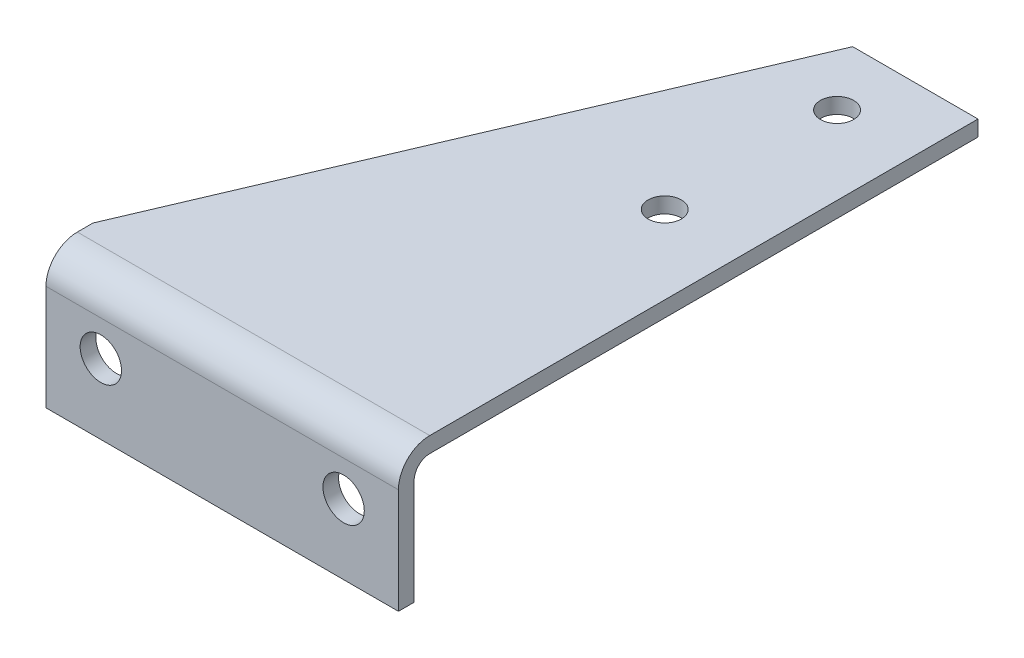
ISO-10303-21;
HEADER;
FILE_DESCRIPTION(('STEP AP214'),'2;1');
FILE_NAME('part.step','',(''),(''),'','','');
FILE_SCHEMA(('AUTOMOTIVE_DESIGN { 1 0 10303 214 1 1 1 1 }'));
ENDSEC;
DATA;
#1=APPLICATION_CONTEXT('core data for automotive mechanical design processes');
#2=APPLICATION_PROTOCOL_DEFINITION('international standard','automotive_design',2000,#1);
#3=PRODUCT_CONTEXT('',#1,'mechanical');
#4=PRODUCT('Part','Part','',(#3));
#5=PRODUCT_RELATED_PRODUCT_CATEGORY('part','',(#4));
#6=PRODUCT_DEFINITION_FORMATION('','',#4);
#7=PRODUCT_DEFINITION_CONTEXT('part definition',#1,'design');
#8=PRODUCT_DEFINITION('design','',#6,#7);
#9=PRODUCT_DEFINITION_SHAPE('','',#8);
#10=(LENGTH_UNIT() NAMED_UNIT(*) SI_UNIT(.MILLI.,.METRE.));
#11=(NAMED_UNIT(*) PLANE_ANGLE_UNIT() SI_UNIT($,.RADIAN.));
#12=(NAMED_UNIT(*) SI_UNIT($,.STERADIAN.) SOLID_ANGLE_UNIT());
#13=UNCERTAINTY_MEASURE_WITH_UNIT(LENGTH_MEASURE(1.E-05),#10,'distance_accuracy_value','');
#14=(GEOMETRIC_REPRESENTATION_CONTEXT(3) GLOBAL_UNCERTAINTY_ASSIGNED_CONTEXT((#13)) GLOBAL_UNIT_ASSIGNED_CONTEXT((#10,
#11,#12)) REPRESENTATION_CONTEXT('',''));
#15=CARTESIAN_POINT('',(0.,0.,0.));
#16=DIRECTION('',(0.,0.,1.));
#17=DIRECTION('',(1.,0.,0.));
#18=AXIS2_PLACEMENT_3D('',#15,#16,#17);
#19=CARTESIAN_POINT('',(-142.875,-6.35000000000001,0.));
#20=DIRECTION('',(0.,0.,-1.));
#21=DIRECTION('',(-1.,0.,0.));
#22=AXIS2_PLACEMENT_3D('',#19,#20,#21);
#23=PLANE('',#22);
#24=DIRECTION('',(0.,1.,0.));
#25=VECTOR('',#24,1.);
#26=CARTESIAN_POINT('',(-50.8,-55.373,0.));
#27=LINE('',#26,#25);
#28=CARTESIAN_POINT('',(-50.8,-6.35000000000004,0.));
#29=VERTEX_POINT('',#28);
#30=CARTESIAN_POINT('',(-50.8,0.,0.));
#31=VERTEX_POINT('',#30);
#32=EDGE_CURVE('E108',#29,#31,#27,.T.);
#33=ORIENTED_EDGE('',*,*,#32,.T.);
#34=DIRECTION('',(1.,0.,0.));
#35=VECTOR('',#34,1.);
#36=CARTESIAN_POINT('',(-142.875,0.,0.));
#37=LINE('',#36,#35);
#38=CARTESIAN_POINT('',(0.,0.,0.));
#39=VERTEX_POINT('',#38);
#40=EDGE_CURVE('E35',#31,#39,#37,.T.);
#41=ORIENTED_EDGE('',*,*,#40,.T.);
#42=DIRECTION('',(0.,1.,0.));
#43=VECTOR('',#42,1.);
#44=CARTESIAN_POINT('',(0.,-6.35000000000001,0.));
#45=LINE('',#44,#43);
#46=CARTESIAN_POINT('',(0.,-6.35000000000001,0.));
#47=VERTEX_POINT('',#46);
#48=EDGE_CURVE('E158',#47,#39,#45,.T.);
#49=ORIENTED_EDGE('',*,*,#48,.F.);
#50=DIRECTION('',(1.,0.,0.));
#51=VECTOR('',#50,1.);
#52=CARTESIAN_POINT('',(-142.875,-6.35000000000001,0.));
#53=LINE('',#52,#51);
#54=EDGE_CURVE('E11',#29,#47,#53,.T.);
#55=ORIENTED_EDGE('',*,*,#54,.F.);
#56=EDGE_LOOP('',(#33,#41,#49,#55));
#57=FACE_BOUND('',#56,.T.);
#58=ADVANCED_FACE('F32',(#57),#23,.T.);
#59=CARTESIAN_POINT('',(-142.875,-6.35000000000003,222.25));
#60=DIRECTION('',(0.,-1.,0.));
#61=DIRECTION('',(0.,0.,-1.));
#62=AXIS2_PLACEMENT_3D('',#59,#60,#61);
#63=PLANE('',#62);
#64=CARTESIAN_POINT('',(-31.75,-6.35000000000002,25.4));
#65=DIRECTION('',(0.,-1.,0.));
#66=DIRECTION('',(0.,0.,-1.));
#67=AXIS2_PLACEMENT_3D('',#64,#65,#66);
#68=CIRCLE('',#67,6.73100000000281);
#69=CARTESIAN_POINT('',(-31.75,-6.35000000000001,18.6689999999972));
#70=VERTEX_POINT('',#69);
#71=EDGE_CURVE('E343',#70,#70,#68,.F.);
#72=ORIENTED_EDGE('',*,*,#71,.T.);
#73=EDGE_LOOP('',(#72));
#74=FACE_BOUND('',#73,.T.);
#75=CARTESIAN_POINT('',(-31.75,-6.35000000000002,95.25));
#76=DIRECTION('',(0.,-1.,0.));
#77=DIRECTION('',(0.,0.,-1.));
#78=AXIS2_PLACEMENT_3D('',#75,#76,#77);
#79=CIRCLE('',#78,6.73100000000281);
#80=CARTESIAN_POINT('',(-31.75,-6.35000000000001,88.5189999999972));
#81=VERTEX_POINT('',#80);
#82=EDGE_CURVE('E347',#81,#81,#79,.F.);
#83=ORIENTED_EDGE('',*,*,#82,.T.);
#84=EDGE_LOOP('',(#83));
#85=FACE_BOUND('',#84,.T.);
#86=DIRECTION('',(0.392286095348589,0.,-0.919843258058762));
#87=VECTOR('',#86,1.);
#88=CARTESIAN_POINT('',(-142.875,-6.35000000000003,215.9));
#89=LINE('',#88,#87);
#90=CARTESIAN_POINT('',(-142.875,-6.35000000000003,215.9));
#91=VERTEX_POINT('',#90);
#92=EDGE_CURVE('E48',#91,#29,#89,.T.);
#93=ORIENTED_EDGE('',*,*,#92,.T.);
#94=ORIENTED_EDGE('',*,*,#54,.T.);
#95=DIRECTION('',(0.,0.,-1.));
#96=VECTOR('',#95,1.);
#97=CARTESIAN_POINT('',(0.,-6.35000000000003,222.25));
#98=LINE('',#97,#96);
#99=CARTESIAN_POINT('',(0.,-6.35000000000003,222.25));
#100=VERTEX_POINT('',#99);
#101=EDGE_CURVE('E123',#100,#47,#98,.T.);
#102=ORIENTED_EDGE('',*,*,#101,.F.);
#103=DIRECTION('',(1.,0.,0.));
#104=VECTOR('',#103,1.);
#105=CARTESIAN_POINT('',(-142.875,-6.35000000000003,222.25));
#106=LINE('',#105,#104);
#107=CARTESIAN_POINT('',(-142.875,-6.35000000000003,222.25));
#108=VERTEX_POINT('',#107);
#109=EDGE_CURVE('E40',#108,#100,#106,.T.);
#110=ORIENTED_EDGE('',*,*,#109,.F.);
#111=DIRECTION('',(0.,0.,-1.));
#112=VECTOR('',#111,1.);
#113=CARTESIAN_POINT('',(-142.875,-6.35000000000003,222.25));
#114=LINE('',#113,#112);
#115=EDGE_CURVE('E142',#108,#91,#114,.T.);
#116=ORIENTED_EDGE('',*,*,#115,.T.);
#117=EDGE_LOOP('',(#93,#94,#102,#110,#116));
#118=FACE_BOUND('',#117,.T.);
#119=ADVANCED_FACE('F186',(#74,#85,#118),#63,.T.);
#120=CARTESIAN_POINT('',(-142.875,-12.7,222.25));
#121=DIRECTION('',(1.,0.,0.));
#122=DIRECTION('',(0.,0.,-1.));
#123=AXIS2_PLACEMENT_3D('',#120,#121,#122);
#124=CYLINDRICAL_SURFACE('',#123,6.35);
#125=CARTESIAN_POINT('',(0.,-12.7,222.25));
#126=DIRECTION('',(-1.,0.,0.));
#127=DIRECTION('',(0.,0.,1.));
#128=AXIS2_PLACEMENT_3D('',#125,#126,#127);
#129=CIRCLE('',#128,6.35);
#130=CARTESIAN_POINT('',(0.,-12.7,228.6));
#131=VERTEX_POINT('',#130);
#132=EDGE_CURVE('E128',#131,#100,#129,.T.);
#133=ORIENTED_EDGE('',*,*,#132,.F.);
#134=DIRECTION('',(1.,0.,0.));
#135=VECTOR('',#134,1.);
#136=CARTESIAN_POINT('',(-142.875,-12.7,228.6));
#137=LINE('',#136,#135);
#138=CARTESIAN_POINT('',(-142.875,-12.7,228.6));
#139=VERTEX_POINT('',#138);
#140=EDGE_CURVE('E145',#139,#131,#137,.T.);
#141=ORIENTED_EDGE('',*,*,#140,.F.);
#142=CARTESIAN_POINT('',(-142.875,-12.7,222.25));
#143=DIRECTION('',(-1.,0.,0.));
#144=DIRECTION('',(0.,0.,1.));
#145=AXIS2_PLACEMENT_3D('',#142,#143,#144);
#146=CIRCLE('',#145,6.35);
#147=EDGE_CURVE('E140',#139,#108,#146,.T.);
#148=ORIENTED_EDGE('',*,*,#147,.T.);
#149=ORIENTED_EDGE('',*,*,#109,.T.);
#150=EDGE_LOOP('',(#133,#141,#148,#149));
#151=FACE_BOUND('',#150,.T.);
#152=ADVANCED_FACE('F230',(#151),#124,.F.);
#153=CARTESIAN_POINT('',(-142.875,-55.372,228.6));
#154=DIRECTION('',(0.,0.,-1.));
#155=DIRECTION('',(-1.,0.,0.));
#156=AXIS2_PLACEMENT_3D('',#153,#154,#155);
#157=PLANE('',#156);
#158=CARTESIAN_POINT('',(-22.225,-26.9875000000002,228.6));
#159=DIRECTION('',(0.,0.,-1.));
#160=DIRECTION('',(-1.,0.,0.));
#161=AXIS2_PLACEMENT_3D('',#158,#159,#160);
#162=CIRCLE('',#161,8.382);
#163=CARTESIAN_POINT('',(-30.607,-26.9875000000002,228.6));
#164=VERTEX_POINT('',#163);
#165=EDGE_CURVE('E187',#164,#164,#162,.F.);
#166=ORIENTED_EDGE('',*,*,#165,.T.);
#167=EDGE_LOOP('',(#166));
#168=FACE_BOUND('',#167,.T.);
#169=CARTESIAN_POINT('',(-120.65,-26.9875000000002,228.6));
#170=DIRECTION('',(0.,0.,-1.));
#171=DIRECTION('',(-1.,0.,0.));
#172=AXIS2_PLACEMENT_3D('',#169,#170,#171);
#173=CIRCLE('',#172,8.382);
#174=CARTESIAN_POINT('',(-129.032,-26.9875000000002,228.6));
#175=VERTEX_POINT('',#174);
#176=EDGE_CURVE('E170',#175,#175,#173,.F.);
#177=ORIENTED_EDGE('',*,*,#176,.T.);
#178=EDGE_LOOP('',(#177));
#179=FACE_BOUND('',#178,.T.);
#180=DIRECTION('',(0.,1.,0.));
#181=VECTOR('',#180,1.);
#182=CARTESIAN_POINT('',(0.,-55.372,228.6));
#183=LINE('',#182,#181);
#184=CARTESIAN_POINT('',(0.,-55.372,228.6));
#185=VERTEX_POINT('',#184);
#186=EDGE_CURVE('E181',#185,#131,#183,.T.);
#187=ORIENTED_EDGE('',*,*,#186,.F.);
#188=DIRECTION('',(1.,0.,0.));
#189=VECTOR('',#188,1.);
#190=CARTESIAN_POINT('',(-142.875,-55.372,228.6));
#191=LINE('',#190,#189);
#192=CARTESIAN_POINT('',(-142.875,-55.372,228.6));
#193=VERTEX_POINT('',#192);
#194=EDGE_CURVE('E147',#193,#185,#191,.T.);
#195=ORIENTED_EDGE('',*,*,#194,.F.);
#196=DIRECTION('',(0.,1.,0.));
#197=VECTOR('',#196,1.);
#198=CARTESIAN_POINT('',(-142.875,-55.372,228.6));
#199=LINE('',#198,#197);
#200=EDGE_CURVE('E137',#193,#139,#199,.T.);
#201=ORIENTED_EDGE('',*,*,#200,.T.);
#202=ORIENTED_EDGE('',*,*,#140,.T.);
#203=EDGE_LOOP('',(#187,#195,#201,#202));
#204=FACE_BOUND('',#203,.T.);
#205=ADVANCED_FACE('F200',(#168,#179,#204),#157,.T.);
#206=CARTESIAN_POINT('',(-142.875,-55.372,234.95));
#207=DIRECTION('',(0.,-1.,0.));
#208=DIRECTION('',(0.,0.,-1.));
#209=AXIS2_PLACEMENT_3D('',#206,#207,#208);
#210=PLANE('',#209);
#211=DIRECTION('',(0.,0.,-1.));
#212=VECTOR('',#211,1.);
#213=CARTESIAN_POINT('',(0.,-55.372,234.95));
#214=LINE('',#213,#212);
#215=CARTESIAN_POINT('',(0.,-55.372,234.95));
#216=VERTEX_POINT('',#215);
#217=EDGE_CURVE('E178',#216,#185,#214,.T.);
#218=ORIENTED_EDGE('',*,*,#217,.F.);
#219=DIRECTION('',(1.,0.,0.));
#220=VECTOR('',#219,1.);
#221=CARTESIAN_POINT('',(-142.875,-55.372,234.95));
#222=LINE('',#221,#220);
#223=CARTESIAN_POINT('',(-142.875,-55.372,234.95));
#224=VERTEX_POINT('',#223);
#225=EDGE_CURVE('E149',#224,#216,#222,.T.);
#226=ORIENTED_EDGE('',*,*,#225,.F.);
#227=DIRECTION('',(0.,0.,-1.));
#228=VECTOR('',#227,1.);
#229=CARTESIAN_POINT('',(-142.875,-55.372,234.95));
#230=LINE('',#229,#228);
#231=EDGE_CURVE('E134',#224,#193,#230,.T.);
#232=ORIENTED_EDGE('',*,*,#231,.T.);
#233=ORIENTED_EDGE('',*,*,#194,.T.);
#234=EDGE_LOOP('',(#218,#226,#232,#233));
#235=FACE_BOUND('',#234,.T.);
#236=ADVANCED_FACE('F214',(#235),#210,.T.);
#237=CARTESIAN_POINT('',(-142.875,-12.7,234.95));
#238=DIRECTION('',(0.,0.,1.));
#239=DIRECTION('',(0.,-1.,0.));
#240=AXIS2_PLACEMENT_3D('',#237,#238,#239);
#241=PLANE('',#240);
#242=CARTESIAN_POINT('',(-22.225,-26.9875000000002,234.95));
#243=DIRECTION('',(0.,0.,1.));
#244=DIRECTION('',(1.,0.,0.));
#245=AXIS2_PLACEMENT_3D('',#242,#243,#244);
#246=CIRCLE('',#245,8.382);
#247=CARTESIAN_POINT('',(-13.843,-26.9875000000002,234.95));
#248=VERTEX_POINT('',#247);
#249=EDGE_CURVE('E190',#248,#248,#246,.T.);
#250=ORIENTED_EDGE('',*,*,#249,.F.);
#251=EDGE_LOOP('',(#250));
#252=FACE_BOUND('',#251,.T.);
#253=CARTESIAN_POINT('',(-120.65,-26.9875000000002,234.95));
#254=DIRECTION('',(0.,0.,1.));
#255=DIRECTION('',(1.,0.,0.));
#256=AXIS2_PLACEMENT_3D('',#253,#254,#255);
#257=CIRCLE('',#256,8.382);
#258=CARTESIAN_POINT('',(-112.268,-26.9875000000002,234.95));
#259=VERTEX_POINT('',#258);
#260=EDGE_CURVE('E167',#259,#259,#257,.T.);
#261=ORIENTED_EDGE('',*,*,#260,.F.);
#262=EDGE_LOOP('',(#261));
#263=FACE_BOUND('',#262,.T.);
#264=DIRECTION('',(0.,-1.,0.));
#265=VECTOR('',#264,1.);
#266=CARTESIAN_POINT('',(0.,-12.7,234.95));
#267=LINE('',#266,#265);
#268=CARTESIAN_POINT('',(0.,-12.7,234.95));
#269=VERTEX_POINT('',#268);
#270=EDGE_CURVE('E175',#269,#216,#267,.T.);
#271=ORIENTED_EDGE('',*,*,#270,.F.);
#272=DIRECTION('',(1.,0.,0.));
#273=VECTOR('',#272,1.);
#274=CARTESIAN_POINT('',(-142.875,-12.7,234.95));
#275=LINE('',#274,#273);
#276=CARTESIAN_POINT('',(-142.875,-12.7,234.95));
#277=VERTEX_POINT('',#276);
#278=EDGE_CURVE('E151',#277,#269,#275,.T.);
#279=ORIENTED_EDGE('',*,*,#278,.F.);
#280=DIRECTION('',(0.,-1.,0.));
#281=VECTOR('',#280,1.);
#282=CARTESIAN_POINT('',(-142.875,-12.7,234.95));
#283=LINE('',#282,#281);
#284=EDGE_CURVE('E125',#277,#224,#283,.T.);
#285=ORIENTED_EDGE('',*,*,#284,.T.);
#286=ORIENTED_EDGE('',*,*,#225,.T.);
#287=EDGE_LOOP('',(#271,#279,#285,#286));
#288=FACE_BOUND('',#287,.T.);
#289=ADVANCED_FACE('F210',(#252,#263,#288),#241,.T.);
#290=CARTESIAN_POINT('',(-142.875,-12.7,222.25));
#291=DIRECTION('',(1.,0.,0.));
#292=DIRECTION('',(0.,0.,-1.));
#293=AXIS2_PLACEMENT_3D('',#290,#291,#292);
#294=CYLINDRICAL_SURFACE('',#293,12.7);
#295=CARTESIAN_POINT('',(0.,-12.7,222.25));
#296=DIRECTION('',(1.,0.,0.));
#297=DIRECTION('',(0.,0.,1.));
#298=AXIS2_PLACEMENT_3D('',#295,#296,#297);
#299=CIRCLE('',#298,12.7);
#300=CARTESIAN_POINT('',(0.,0.,222.25));
#301=VERTEX_POINT('',#300);
#302=EDGE_CURVE('E163',#301,#269,#299,.T.);
#303=ORIENTED_EDGE('',*,*,#302,.F.);
#304=DIRECTION('',(1.,0.,0.));
#305=VECTOR('',#304,1.);
#306=CARTESIAN_POINT('',(-142.875,0.,222.25));
#307=LINE('',#306,#305);
#308=CARTESIAN_POINT('',(-142.875,0.,222.25));
#309=VERTEX_POINT('',#308);
#310=EDGE_CURVE('E152',#309,#301,#307,.T.);
#311=ORIENTED_EDGE('',*,*,#310,.F.);
#312=CARTESIAN_POINT('',(-142.875,-12.7,222.25));
#313=DIRECTION('',(1.,0.,0.));
#314=DIRECTION('',(0.,0.,1.));
#315=AXIS2_PLACEMENT_3D('',#312,#313,#314);
#316=CIRCLE('',#315,12.7);
#317=EDGE_CURVE('E122',#309,#277,#316,.T.);
#318=ORIENTED_EDGE('',*,*,#317,.T.);
#319=ORIENTED_EDGE('',*,*,#278,.T.);
#320=EDGE_LOOP('',(#303,#311,#318,#319));
#321=FACE_BOUND('',#320,.T.);
#322=ADVANCED_FACE('F213',(#321),#294,.T.);
#323=CARTESIAN_POINT('',(-142.875,0.,0.));
#324=DIRECTION('',(0.,1.,0.));
#325=DIRECTION('',(0.,0.,1.));
#326=AXIS2_PLACEMENT_3D('',#323,#324,#325);
#327=PLANE('',#326);
#328=CARTESIAN_POINT('',(-31.75,0.,25.4));
#329=DIRECTION('',(0.,1.,0.));
#330=DIRECTION('',(0.,0.,1.));
#331=AXIS2_PLACEMENT_3D('',#328,#329,#330);
#332=CIRCLE('',#331,6.73100000000281);
#333=CARTESIAN_POINT('',(-31.75,0.,32.1310000000028));
#334=VERTEX_POINT('',#333);
#335=EDGE_CURVE('E346',#334,#334,#332,.T.);
#336=ORIENTED_EDGE('',*,*,#335,.F.);
#337=EDGE_LOOP('',(#336));
#338=FACE_BOUND('',#337,.T.);
#339=CARTESIAN_POINT('',(-31.75,0.,95.25));
#340=DIRECTION('',(0.,1.,0.));
#341=DIRECTION('',(0.,0.,1.));
#342=AXIS2_PLACEMENT_3D('',#339,#340,#341);
#343=CIRCLE('',#342,6.73100000000281);
#344=CARTESIAN_POINT('',(-31.75,0.,101.981000000003));
#345=VERTEX_POINT('',#344);
#346=EDGE_CURVE('E116',#345,#345,#343,.T.);
#347=ORIENTED_EDGE('',*,*,#346,.F.);
#348=EDGE_LOOP('',(#347));
#349=FACE_BOUND('',#348,.T.);
#350=DIRECTION('',(0.392286095348589,0.,-0.919843258058762));
#351=VECTOR('',#350,1.);
#352=CARTESIAN_POINT('',(-142.875,0.,215.9));
#353=LINE('',#352,#351);
#354=CARTESIAN_POINT('',(-142.875,0.,215.9));
#355=VERTEX_POINT('',#354);
#356=EDGE_CURVE('E103',#355,#31,#353,.T.);
#357=ORIENTED_EDGE('',*,*,#356,.F.);
#358=DIRECTION('',(0.,0.,1.));
#359=VECTOR('',#358,1.);
#360=CARTESIAN_POINT('',(-142.875,0.,0.));
#361=LINE('',#360,#359);
#362=EDGE_CURVE('E113',#355,#309,#361,.T.);
#363=ORIENTED_EDGE('',*,*,#362,.T.);
#364=ORIENTED_EDGE('',*,*,#310,.T.);
#365=DIRECTION('',(0.,0.,1.));
#366=VECTOR('',#365,1.);
#367=CARTESIAN_POINT('',(0.,0.,0.));
#368=LINE('',#367,#366);
#369=EDGE_CURVE('E160',#39,#301,#368,.T.);
#370=ORIENTED_EDGE('',*,*,#369,.F.);
#371=ORIENTED_EDGE('',*,*,#40,.F.);
#372=EDGE_LOOP('',(#357,#363,#364,#370,#371));
#373=FACE_BOUND('',#372,.T.);
#374=ADVANCED_FACE('F112',(#338,#349,#373),#327,.T.);
#375=CARTESIAN_POINT('',(-142.875,-12.7,222.25));
#376=DIRECTION('',(-1.,0.,0.));
#377=DIRECTION('',(0.,0.,1.));
#378=AXIS2_PLACEMENT_3D('',#375,#376,#377);
#379=PLANE('',#378);
#380=DIRECTION('',(0.,1.,0.));
#381=VECTOR('',#380,1.);
#382=CARTESIAN_POINT('',(-142.875,-55.3730000000001,215.9));
#383=LINE('',#382,#381);
#384=EDGE_CURVE('E100',#91,#355,#383,.T.);
#385=ORIENTED_EDGE('',*,*,#384,.F.);
#386=ORIENTED_EDGE('',*,*,#115,.F.);
#387=ORIENTED_EDGE('',*,*,#147,.F.);
#388=ORIENTED_EDGE('',*,*,#200,.F.);
#389=ORIENTED_EDGE('',*,*,#231,.F.);
#390=ORIENTED_EDGE('',*,*,#284,.F.);
#391=ORIENTED_EDGE('',*,*,#317,.F.);
#392=ORIENTED_EDGE('',*,*,#362,.F.);
#393=EDGE_LOOP('',(#385,#386,#387,#388,#389,#390,#391,#392));
#394=FACE_BOUND('',#393,.T.);
#395=ADVANCED_FACE('F119',(#394),#379,.T.);
#396=CARTESIAN_POINT('',(0.,-12.7,222.25));
#397=DIRECTION('',(-1.,0.,0.));
#398=DIRECTION('',(0.,0.,1.));
#399=AXIS2_PLACEMENT_3D('',#396,#397,#398);
#400=PLANE('',#399);
#401=ORIENTED_EDGE('',*,*,#48,.T.);
#402=ORIENTED_EDGE('',*,*,#369,.T.);
#403=ORIENTED_EDGE('',*,*,#302,.T.);
#404=ORIENTED_EDGE('',*,*,#270,.T.);
#405=ORIENTED_EDGE('',*,*,#217,.T.);
#406=ORIENTED_EDGE('',*,*,#186,.T.);
#407=ORIENTED_EDGE('',*,*,#132,.T.);
#408=ORIENTED_EDGE('',*,*,#101,.T.);
#409=EDGE_LOOP('',(#401,#402,#403,#404,#405,#406,#407,#408));
#410=FACE_BOUND('',#409,.T.);
#411=ADVANCED_FACE('F165',(#410),#400,.F.);
#412=CARTESIAN_POINT('',(-120.65,-26.9875000000002,-0.001000000000001));
#413=DIRECTION('',(0.,0.,1.));
#414=DIRECTION('',(1.,0.,0.));
#415=AXIS2_PLACEMENT_3D('',#412,#413,#414);
#416=CYLINDRICAL_SURFACE('',#415,8.382);
#417=ORIENTED_EDGE('',*,*,#176,.F.);
#418=EDGE_LOOP('',(#417));
#419=FACE_BOUND('',#418,.T.);
#420=ORIENTED_EDGE('',*,*,#260,.T.);
#421=EDGE_LOOP('',(#420));
#422=FACE_BOUND('',#421,.T.);
#423=ADVANCED_FACE('F203',(#419,#422),#416,.F.);
#424=CARTESIAN_POINT('',(-22.225,-26.9875000000002,-0.001000000000001));
#425=DIRECTION('',(0.,0.,1.));
#426=DIRECTION('',(1.,0.,0.));
#427=AXIS2_PLACEMENT_3D('',#424,#425,#426);
#428=CYLINDRICAL_SURFACE('',#427,8.382);
#429=ORIENTED_EDGE('',*,*,#165,.F.);
#430=EDGE_LOOP('',(#429));
#431=FACE_BOUND('',#430,.T.);
#432=ORIENTED_EDGE('',*,*,#249,.T.);
#433=EDGE_LOOP('',(#432));
#434=FACE_BOUND('',#433,.T.);
#435=ADVANCED_FACE('F206',(#431,#434),#428,.F.);
#436=CARTESIAN_POINT('',(-142.875,-55.3730000000001,215.9));
#437=DIRECTION('',(0.919843258058762,0.,0.392286095348589));
#438=DIRECTION('',(0.392286095348589,0.,-0.919843258058762));
#439=AXIS2_PLACEMENT_3D('',#436,#437,#438);
#440=PLANE('',#439);
#441=ORIENTED_EDGE('',*,*,#384,.T.);
#442=ORIENTED_EDGE('',*,*,#356,.T.);
#443=ORIENTED_EDGE('',*,*,#32,.F.);
#444=ORIENTED_EDGE('',*,*,#92,.F.);
#445=EDGE_LOOP('',(#441,#442,#443,#444));
#446=FACE_BOUND('',#445,.T.);
#447=ADVANCED_FACE('F102',(#446),#440,.F.);
#448=CARTESIAN_POINT('',(-31.75,-55.373,95.25));
#449=DIRECTION('',(0.,1.,0.));
#450=DIRECTION('',(0.,0.,1.));
#451=AXIS2_PLACEMENT_3D('',#448,#449,#450);
#452=CYLINDRICAL_SURFACE('',#451,6.73100000000281);
#453=ORIENTED_EDGE('',*,*,#82,.F.);
#454=EDGE_LOOP('',(#453));
#455=FACE_BOUND('',#454,.T.);
#456=ORIENTED_EDGE('',*,*,#346,.T.);
#457=EDGE_LOOP('',(#456));
#458=FACE_BOUND('',#457,.T.);
#459=ADVANCED_FACE('F311',(#455,#458),#452,.F.);
#460=CARTESIAN_POINT('',(-31.75,-55.373,25.4));
#461=DIRECTION('',(0.,1.,0.));
#462=DIRECTION('',(0.,0.,1.));
#463=AXIS2_PLACEMENT_3D('',#460,#461,#462);
#464=CYLINDRICAL_SURFACE('',#463,6.73100000000281);
#465=ORIENTED_EDGE('',*,*,#71,.F.);
#466=EDGE_LOOP('',(#465));
#467=FACE_BOUND('',#466,.T.);
#468=ORIENTED_EDGE('',*,*,#335,.T.);
#469=EDGE_LOOP('',(#468));
#470=FACE_BOUND('',#469,.T.);
#471=ADVANCED_FACE('F320',(#467,#470),#464,.F.);
#472=CLOSED_SHELL('',(#58,#119,#152,#205,#236,#289,#322,#374,#395,#411,#423,#435,#447,#459,#471));
#473=MANIFOLD_SOLID_BREP('B2',#472);
#474=ADVANCED_BREP_SHAPE_REPRESENTATION('',(#18,#473),#14);
#475=SHAPE_DEFINITION_REPRESENTATION(#9,#474);
ENDSEC;
END-ISO-10303-21;
